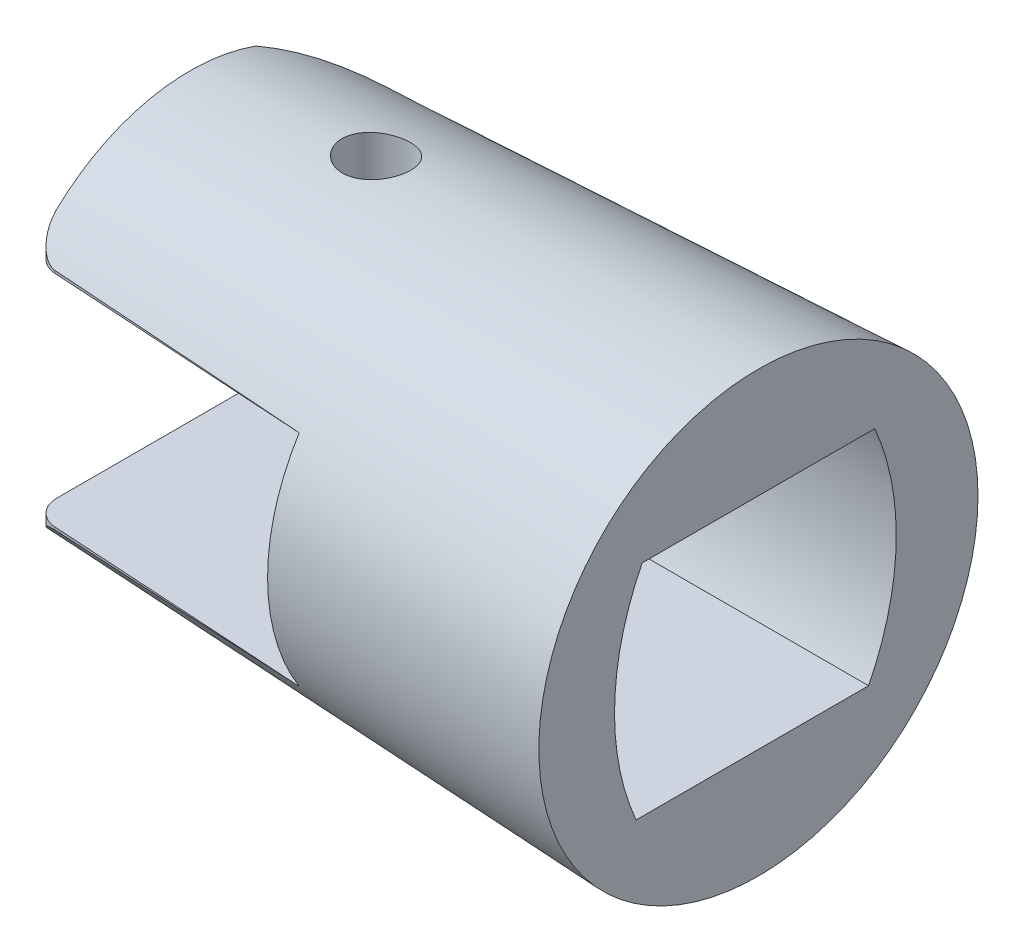
ISO-10303-21;
HEADER;
FILE_DESCRIPTION(('STEP AP214'),'2;1');
FILE_NAME('part.step','',(''),(''),'','','');
FILE_SCHEMA(('AUTOMOTIVE_DESIGN { 1 0 10303 214 1 1 1 1 }'));
ENDSEC;
DATA;
#1=APPLICATION_CONTEXT('core data for automotive mechanical design processes');
#2=APPLICATION_PROTOCOL_DEFINITION('international standard','automotive_design',2000,#1);
#3=PRODUCT_CONTEXT('',#1,'mechanical');
#4=PRODUCT('Part','Part','',(#3));
#5=PRODUCT_RELATED_PRODUCT_CATEGORY('part','',(#4));
#6=PRODUCT_DEFINITION_FORMATION('','',#4);
#7=PRODUCT_DEFINITION_CONTEXT('part definition',#1,'design');
#8=PRODUCT_DEFINITION('design','',#6,#7);
#9=PRODUCT_DEFINITION_SHAPE('','',#8);
#10=(LENGTH_UNIT() NAMED_UNIT(*) SI_UNIT(.MILLI.,.METRE.));
#11=(NAMED_UNIT(*) PLANE_ANGLE_UNIT() SI_UNIT($,.RADIAN.));
#12=(NAMED_UNIT(*) SI_UNIT($,.STERADIAN.) SOLID_ANGLE_UNIT());
#13=UNCERTAINTY_MEASURE_WITH_UNIT(LENGTH_MEASURE(1.E-05),#10,'distance_accuracy_value','');
#14=(GEOMETRIC_REPRESENTATION_CONTEXT(3) GLOBAL_UNCERTAINTY_ASSIGNED_CONTEXT((#13)) GLOBAL_UNIT_ASSIGNED_CONTEXT((#10,
#11,#12)) REPRESENTATION_CONTEXT('',''));
#15=CARTESIAN_POINT('',(0.,0.,0.));
#16=DIRECTION('',(0.,0.,1.));
#17=DIRECTION('',(1.,0.,0.));
#18=AXIS2_PLACEMENT_3D('',#15,#16,#17);
#19=CARTESIAN_POINT('',(-9.1685,0.,8.335));
#20=DIRECTION('',(1.,0.,0.));
#21=DIRECTION('',(0.,0.,-1.));
#22=AXIS2_PLACEMENT_3D('',#19,#20,#21);
#23=PLANE('',#22);
#24=DIRECTION('',(0.,0.,-1.));
#25=VECTOR('',#24,1.);
#26=CARTESIAN_POINT('',(-9.1685,3.542375,8.335));
#27=LINE('',#26,#25);
#28=CARTESIAN_POINT('',(-9.1685,3.542375,5.64923033336179));
#29=VERTEX_POINT('',#28);
#30=CARTESIAN_POINT('',(-9.1685,3.542375,3.75075));
#31=VERTEX_POINT('',#30);
#32=EDGE_CURVE('E238',#29,#31,#27,.T.);
#33=ORIENTED_EDGE('',*,*,#32,.T.);
#34=CARTESIAN_POINT('',(-9.1685,-0.208374999999956,-3.69264300571321));
#35=DIRECTION('',(1.,0.,0.));
#36=DIRECTION('',(0.,0.,-1.));
#37=AXIS2_PLACEMENT_3D('',#34,#35,#36);
#38=CIRCLE('',#37,8.335);
#39=CARTESIAN_POINT('',(-9.1685,-3.542375,3.94651067777816));
#40=VERTEX_POINT('',#39);
#41=EDGE_CURVE('E359',#31,#40,#38,.T.);
#42=ORIENTED_EDGE('',*,*,#41,.T.);
#43=DIRECTION('',(0.,0.,-1.));
#44=VECTOR('',#43,1.);
#45=CARTESIAN_POINT('',(-9.1685,-3.542375,8.335));
#46=LINE('',#45,#44);
#47=CARTESIAN_POINT('',(-9.1685,-3.542375,5.64923033336179));
#48=VERTEX_POINT('',#47);
#49=EDGE_CURVE('E242',#48,#40,#46,.T.);
#50=ORIENTED_EDGE('',*,*,#49,.F.);
#51=CARTESIAN_POINT('',(-9.1685,0.,0.));
#52=DIRECTION('',(1.,0.,0.));
#53=DIRECTION('',(0.,0.,-1.));
#54=AXIS2_PLACEMENT_3D('',#51,#52,#53);
#55=CIRCLE('',#54,6.668);
#56=EDGE_CURVE('E425',#48,#29,#55,.F.);
#57=ORIENTED_EDGE('',*,*,#56,.T.);
#58=EDGE_LOOP('',(#33,#42,#50,#57));
#59=FACE_BOUND('',#58,.T.);
#60=ADVANCED_FACE('F39',(#59),#23,.F.);
#61=CARTESIAN_POINT('',(-18.337,0.,0.));
#62=DIRECTION('',(1.,0.,0.));
#63=DIRECTION('',(0.,0.,-1.));
#64=AXIS2_PLACEMENT_3D('',#61,#62,#63);
#65=CONICAL_SURFACE('',#64,6.25125,0.0454232794215771);
#66=CARTESIAN_POINT('',(-13.5019586071199,6.36971735423623,-1.14055263552959));
#67=CARTESIAN_POINT('',(-13.4617716610966,6.36412320489724,-1.18215851716733));
#68=CARTESIAN_POINT('',(-13.4180697769176,6.35886841394281,-1.22045594766293));
#69=CARTESIAN_POINT('',(-13.3247991760596,6.3495885473435,-1.28933223952378));
#70=CARTESIAN_POINT('',(-13.2752260093137,6.34556441284183,-1.31990519051114));
#71=CARTESIAN_POINT('',(-13.1715607820635,6.33923527470254,-1.37242241009831));
#72=CARTESIAN_POINT('',(-13.117466539542,6.33693110656639,-1.39436248269411));
#73=CARTESIAN_POINT('',(-13.0063419314616,6.33440801953943,-1.42891486433509));
#74=CARTESIAN_POINT('',(-12.9493123346254,6.33418855746263,-1.44152960237701));
#75=CARTESIAN_POINT('',(-12.8347742077037,6.33599941357175,-1.45695979163238));
#76=CARTESIAN_POINT('',(-12.7772828822114,6.33799901770215,-1.45990684419627));
#77=CARTESIAN_POINT('',(-12.66271516082,6.34416589084581,-1.45632592736047));
#78=CARTESIAN_POINT('',(-12.605638771797,6.34833319569773,-1.44979780130418));
#79=CARTESIAN_POINT('',(-12.4935917215413,6.35859421090259,-1.42754270438878));
#80=CARTESIAN_POINT('',(-12.4386178068363,6.36468479763606,-1.4118306143207));
#81=CARTESIAN_POINT('',(-12.3321352976627,6.37839738600322,-1.3717331538246));
#82=CARTESIAN_POINT('',(-12.2806271160016,6.38601956963775,-1.34734675235603));
#83=CARTESIAN_POINT('',(-12.18128278678,6.40246453529107,-1.28997421611997));
#84=CARTESIAN_POINT('',(-12.1335544490278,6.4113103447212,-1.25680804585946));
#85=CARTESIAN_POINT('',(-12.0443049808552,6.4294504705834,-1.18306878783295));
#86=CARTESIAN_POINT('',(-12.0027847443369,6.4387448513507,-1.14249463525903));
#87=CARTESIAN_POINT('',(-11.9261868389199,6.45735080289865,-1.05402953077276));
#88=CARTESIAN_POINT('',(-11.8912716887303,6.46665822080961,-1.00599678847637));
#89=CARTESIAN_POINT('',(-11.8300392561206,6.48443127201885,-0.904587548632134));
#90=CARTESIAN_POINT('',(-11.8037219229022,6.49289691029039,-0.851211082658893));
#91=CARTESIAN_POINT('',(-11.7605673710761,6.50839634642142,-0.740753092794572));
#92=CARTESIAN_POINT('',(-11.7437001489029,6.51543463011493,-0.683683944152812));
#93=CARTESIAN_POINT('',(-11.7199043216311,6.52768142906514,-0.5673206259941));
#94=CARTESIAN_POINT('',(-11.7129742159587,6.53289022049819,-0.508026793807789));
#95=CARTESIAN_POINT('',(-11.7093849880709,6.54112892195211,-0.390331837808212));
#96=CARTESIAN_POINT('',(-11.7124966428106,6.54420553883841,-0.331940938549513));
#97=CARTESIAN_POINT('',(-11.7284528636226,6.54831759628682,-0.216433119904561));
#98=CARTESIAN_POINT('',(-11.7412965600254,6.54935321920535,-0.159316087153193));
#99=CARTESIAN_POINT('',(-11.7760988297337,6.54952034401941,-0.0488478875469218));
#100=CARTESIAN_POINT('',(-11.7979219574535,6.54867935238531,0.00454600412940594));
#101=CARTESIAN_POINT('',(-11.8500413478639,6.54543836097601,0.106971117293568));
#102=CARTESIAN_POINT('',(-11.8803378998413,6.54303830796999,0.156002189757258));
#103=CARTESIAN_POINT('',(-11.9487637690071,6.53706266680899,0.248659267568058));
#104=CARTESIAN_POINT('',(-11.9869420357534,6.53347964418474,0.292248622895797));
#105=CARTESIAN_POINT('',(-12.0699463889913,6.5256183650566,0.372482766406914));
#106=CARTESIAN_POINT('',(-12.1147730135448,6.52134005227914,0.409126991963027));
#107=CARTESIAN_POINT('',(-12.2105192248659,6.51251616246562,0.474949307668604));
#108=CARTESIAN_POINT('',(-12.2615150564167,6.50796769053918,0.50401616441915));
#109=CARTESIAN_POINT('',(-12.3676767434695,6.49912926922087,0.553197692165533));
#110=CARTESIAN_POINT('',(-12.4228426803699,6.49483932487825,0.573312188362952));
#111=CARTESIAN_POINT('',(-12.5360268180653,6.48688441787331,0.604069794275445));
#112=CARTESIAN_POINT('',(-12.5940550496525,6.48322188905757,0.614676666624468));
#113=CARTESIAN_POINT('',(-12.7111177857693,6.47679656328705,0.625960067390901));
#114=CARTESIAN_POINT('',(-12.7701522518324,6.47403373201934,0.626636974563733));
#115=CARTESIAN_POINT('',(-12.8871853496133,6.46951565682789,0.618044415914073));
#116=CARTESIAN_POINT('',(-12.945188009972,6.46775464310156,0.608832807187881));
#117=CARTESIAN_POINT('',(-13.0588447326471,6.46514461624008,0.580803416808242));
#118=CARTESIAN_POINT('',(-13.1144988188864,6.46429559381307,0.561985733029535));
#119=CARTESIAN_POINT('',(-13.2217147354103,6.463291566282,0.515342450749402));
#120=CARTESIAN_POINT('',(-13.2732875432475,6.46313463268588,0.487542114845974));
#121=CARTESIAN_POINT('',(-13.3710551867452,6.46317931937109,0.42370430359521));
#122=CARTESIAN_POINT('',(-13.4172499008782,6.46338094775309,0.38766664216553));
#123=CARTESIAN_POINT('',(-13.503075999236,6.46374889883846,0.308261270240583));
#124=CARTESIAN_POINT('',(-13.5426891103938,6.46391512359644,0.264873805897088));
#125=CARTESIAN_POINT('',(-13.6140744308321,6.46380459058346,0.172067695741732));
#126=CARTESIAN_POINT('',(-13.645846696026,6.46352783597151,0.122649092941949));
#127=CARTESIAN_POINT('',(-13.7006424871472,6.46217164566769,0.0191969680552835));
#128=CARTESIAN_POINT('',(-13.723667328069,6.46109233069637,-0.0348358588813609));
#129=CARTESIAN_POINT('',(-13.7603213138993,6.4578703411098,-0.14596681063447));
#130=CARTESIAN_POINT('',(-13.7739510396044,6.4557277322404,-0.203064745733775));
#131=CARTESIAN_POINT('',(-13.7914128051149,6.45026810792188,-0.318462500793822));
#132=CARTESIAN_POINT('',(-13.7952815611174,6.44695554707829,-0.376756982727878));
#133=CARTESIAN_POINT('',(-13.7932510697703,6.43919387140256,-0.493109693253891));
#134=CARTESIAN_POINT('',(-13.787349941364,6.43474453783999,-0.551167874191741));
#135=CARTESIAN_POINT('',(-13.7659557953699,6.42489931189144,-0.66556489422175));
#136=CARTESIAN_POINT('',(-13.7504366767053,6.41950087249657,-0.721898615498755));
#137=CARTESIAN_POINT('',(-13.7102529447442,6.4081192459103,-0.831103504416173));
#138=CARTESIAN_POINT('',(-13.6855955394343,6.40213652231534,-0.883977362515135));
#139=CARTESIAN_POINT('',(-13.6353283839342,6.39161911118874,-0.971785450895307));
#140=CARTESIAN_POINT('',(-13.6116140479203,6.38711007390803,-1.00782284775294));
#141=CARTESIAN_POINT('',(-13.5599033905768,6.37824365249002,-1.07670352414049));
#142=CARTESIAN_POINT('',(-13.5319070346157,6.37388626957959,-1.10954677783381));
#143=CARTESIAN_POINT('',(-13.5019586071199,6.36971735423623,-1.14055263552959));
#144=B_SPLINE_CURVE_WITH_KNOTS('',3,(#66,#67,#68,#69,#70,#71,#72,#73,#74,#75,#76,#77,#78,#79,
#80,#81,#82,#83,#84,#85,#86,#87,#88,#89,#90,#91,#92,#93,#94,#95,#96,#97,#98,#99,#100,#101,#102,
#103,#104,#105,#106,#107,#108,#109,#110,#111,#112,#113,#114,#115,#116,#117,#118,#119,#120,#121,
#122,#123,#124,#125,#126,#127,#128,#129,#130,#131,#132,#133,#134,#135,#136,#137,#138,#139,#140,
#141,#142,#143),.UNSPECIFIED.,.T.,.F.,(4,2,2,2,2,2,2,2,2,2,2,2,2,2,2,2,2,2,2,2,2,2,2,2,2,2,2,2,
2,2,2,2,2,2,2,2,2,2,4),(0.,0.17419163060013,0.348516142851445,0.522925281043473,
0.697288974362853,0.869269071700755,1.04125201248107,1.21295705848975,1.38468252041971,
1.56024634392888,1.73583542251076,1.91530202996102,2.09476757705439,2.27366005459238,
2.45252551527688,2.62733714810069,2.80213316134307,2.97438395680036,3.14664063370266,
3.32000116030165,3.49337572489717,3.66916783834825,3.84496338406006,4.02142614263797,
4.19788217043695,4.37331136381457,4.54873876980827,4.72367704063105,4.89861926372467,
5.07403935865661,5.24945820262375,5.42485066554725,5.6002322849124,5.77495321053124,
5.94970778016928,6.12493868394182,6.30003166436286,6.42984305195005,6.55965548946091),.UNSPECIFIED.);
#145=CARTESIAN_POINT('',(-13.5019586071199,6.36971735423623,-1.14055263552959));
#146=VERTEX_POINT('',#145);
#147=EDGE_CURVE('E176',#146,#146,#144,.T.);
#148=ORIENTED_EDGE('',*,*,#147,.T.);
#149=EDGE_LOOP('',(#148));
#150=FACE_BOUND('',#149,.T.);
#151=CARTESIAN_POINT('',(-34.6001295167886,0.,4.09215301455892));
#152=DIRECTION('',(-0.0611115794993297,0.,0.998130940734279));
#153=DIRECTION('',(0.998130940734279,0.,0.0611115794993297));
#154=AXIS2_PLACEMENT_3D('',#151,#152,#153);
#155=ELLIPSE('',#154,90.1959478924424,3.69277854081315);
#156=CARTESIAN_POINT('',(-17.5544365015127,-3.62598273709041,5.13579286311213));
#157=VERTEX_POINT('',#156);
#158=EDGE_CURVE('E400',#48,#157,#155,.F.);
#159=ORIENTED_EDGE('',*,*,#158,.T.);
#160=CARTESIAN_POINT('',(-17.5544365015127,-3.62598273709041,5.13579286311213));
#161=CARTESIAN_POINT('',(-17.583578338641,-3.62615305510021,5.13404495612538));
#162=CARTESIAN_POINT('',(-17.6125062314157,-3.62861539501117,5.13070296734978));
#163=CARTESIAN_POINT('',(-17.6689656507649,-3.63752251104676,5.12124743838436));
#164=CARTESIAN_POINT('',(-17.696508765388,-3.64392460620023,5.11516378634124));
#165=CARTESIAN_POINT('',(-17.7564918552416,-3.66214601808035,5.09878250733944));
#166=CARTESIAN_POINT('',(-17.7884538019679,-3.67491465139682,5.08781419705627));
#167=CARTESIAN_POINT('',(-17.8493427885849,-3.70443704825089,5.06293122260578));
#168=CARTESIAN_POINT('',(-17.8782551880181,-3.72120887735227,5.04900323424759));
#169=CARTESIAN_POINT('',(-17.9468773817356,-3.7668456023412,5.01121470566747));
#170=CARTESIAN_POINT('',(-17.9845774938646,-3.79751661816088,4.9859103740255));
#171=CARTESIAN_POINT('',(-18.0534946420006,-3.86262424476388,4.93166864845517));
#172=CARTESIAN_POINT('',(-18.0846979293303,-3.89706861049149,4.9027237537033));
#173=CARTESIAN_POINT('',(-18.1561565024011,-3.9867940927098,4.82612457711569));
#174=CARTESIAN_POINT('',(-18.1925875740409,-4.04353620759744,4.77661404538858));
#175=CARTESIAN_POINT('',(-18.2533209187773,-4.15896232021422,4.67277103625031));
#176=CARTESIAN_POINT('',(-18.2776152478172,-4.21764756308856,4.61843542793194));
#177=CARTESIAN_POINT('',(-18.3094464891307,-4.31968446602477,4.5208072704505));
#178=CARTESIAN_POINT('',(-18.3197091054883,-4.36301387257611,4.47836397856632));
#179=CARTESIAN_POINT('',(-18.3334548818296,-4.44899071780583,4.39207930079882));
#180=CARTESIAN_POINT('',(-18.3369655388141,-4.49164021800987,4.34824432766129));
#181=CARTESIAN_POINT('',(-18.3369999999996,-4.5337625196464,4.30384990188433));
#182=B_SPLINE_CURVE_WITH_KNOTS('',3,(#160,#161,#162,#163,#164,#165,#166,#167,#168,#169,#170,
#171,#172,#173,#174,#175,#176,#177,#178,#179,#180,#181),.UNSPECIFIED.,.F.,.F.,(4,2,2,2,2,2,2,2,
2,2,4),(0.,0.0872990865681886,0.173668681471044,0.281442536723694,0.389712267325943,
0.553177767095839,0.716985755793263,0.966627658277588,1.21643274948652,1.40060693002367,
1.58402946936019),.UNSPECIFIED.);
#183=CARTESIAN_POINT('',(-18.337,-4.53376295265617,4.30385031296005));
#184=VERTEX_POINT('',#183);
#185=EDGE_CURVE('E292',#157,#184,#182,.T.);
#186=ORIENTED_EDGE('',*,*,#185,.T.);
#187=CARTESIAN_POINT('',(-18.337,0.,0.));
#188=DIRECTION('',(1.,0.,0.));
#189=DIRECTION('',(0.,0.,-1.));
#190=AXIS2_PLACEMENT_3D('',#187,#188,#189);
#191=CIRCLE('',#190,6.25125);
#192=CARTESIAN_POINT('',(-18.3369999999998,-5.8780503771636,-2.12759261279666));
#193=VERTEX_POINT('',#192);
#194=EDGE_CURVE('E257',#184,#193,#191,.T.);
#195=ORIENTED_EDGE('',*,*,#194,.T.);
#196=CARTESIAN_POINT('',(-13.7754401732999,-3.26645603018399,-5.57168705696931));
#197=CARTESIAN_POINT('',(-13.8717094362091,-3.29507126284539,-5.54984116061197));
#198=CARTESIAN_POINT('',(-13.9666880454556,-3.32637414193906,-5.52613884687587));
#199=CARTESIAN_POINT('',(-14.1540236520677,-3.39338587430337,-5.47522814931962));
#200=CARTESIAN_POINT('',(-14.2463829346032,-3.42909073201326,-5.44802294400147));
#201=CARTESIAN_POINT('',(-14.5191499221544,-3.54120515527455,-5.36158148398778));
#202=CARTESIAN_POINT('',(-14.6958562728435,-3.62280790989436,-5.29737851759593));
#203=CARTESIAN_POINT('',(-15.0403527723994,-3.79425186113102,-5.15654940984228));
#204=CARTESIAN_POINT('',(-15.2081265578956,-3.88410740753784,-5.07990144470102));
#205=CARTESIAN_POINT('',(-15.5354405550955,-4.06801095022411,-4.91457009551696));
#206=CARTESIAN_POINT('',(-15.6949733652049,-4.16206257863159,-4.82587614321099));
#207=CARTESIAN_POINT('',(-16.004292935241,-4.35019548908239,-4.63770352951522));
#208=CARTESIAN_POINT('',(-16.1541715052233,-4.44426368990333,-4.53836237892293));
#209=CARTESIAN_POINT('',(-16.4462382419243,-4.63120092087278,-4.3280201648454));
#210=CARTESIAN_POINT('',(-16.5884283287625,-4.72407024597643,-4.21702203313578));
#211=CARTESIAN_POINT('',(-16.8645823854979,-4.90643773979513,-3.98347825294889));
#212=CARTESIAN_POINT('',(-16.9985654948046,-4.99594354799199,-3.86096130362993));
#213=CARTESIAN_POINT('',(-17.2580839754008,-5.16995411060878,-3.60406670687434));
#214=CARTESIAN_POINT('',(-17.383620965146,-5.25445982277693,-3.46969134323512));
#215=CARTESIAN_POINT('',(-17.6601114425016,-5.4399008459776,-3.14874656203938));
#216=CARTESIAN_POINT('',(-17.8080603227608,-5.53861914625388,-2.95824383264385));
#217=CARTESIAN_POINT('',(-18.0865513049505,-5.72093712289234,-2.5573704232619));
#218=CARTESIAN_POINT('',(-18.2170416520081,-5.804492098422,-2.34694369653745));
#219=CARTESIAN_POINT('',(-18.3372567700002,-5.87820788440909,-2.12712310623601));
#220=B_SPLINE_CURVE_WITH_KNOTS('',3,(#196,#197,#198,#199,#200,#201,#202,#203,#204,#205,#206,
#207,#208,#209,#210,#211,#212,#213,#214,#215,#216,#217,#218,#219),.UNSPECIFIED.,.F.,.F.,(4,2,2,
2,2,2,2,2,2,2,2,4),(0.,0.308180140413564,0.616082585223789,1.22993431111052,1.84487436158432,
2.4603574428719,3.06867823264603,3.67684639214363,4.28353754533,4.89011211054546,
5.6702363072069,6.4526241866179),.UNSPECIFIED.);
#221=CARTESIAN_POINT('',(-14.5151380486379,-3.542375,-5.36020817523043));
#222=VERTEX_POINT('',#221);
#223=EDGE_CURVE('E230',#222,#193,#220,.T.);
#224=ORIENTED_EDGE('',*,*,#223,.F.);
#225=CARTESIAN_POINT('',(-28.1828731740861,-3.542375,-4.59724186060463));
#226=CARTESIAN_POINT('',(-26.1597058179198,-3.542375,-4.71330833390136));
#227=CARTESIAN_POINT('',(-24.1364489880277,-3.542375,-4.82780201974059));
#228=CARTESIAN_POINT('',(-20.0897889998782,-3.542375,-5.0541442581559));
#229=CARTESIAN_POINT('',(-18.0663858417472,-3.542375,-5.16599281298854));
#230=CARTESIAN_POINT('',(-14.019462891506,-3.542375,-5.38754539849803));
#231=CARTESIAN_POINT('',(-11.9959430994265,-3.542375,-5.49724942973389));
#232=CARTESIAN_POINT('',(-7.94880577235176,-3.542375,-5.71485910581219));
#233=CARTESIAN_POINT('',(-5.92518823730331,-3.542375,-5.82276474966326));
#234=CARTESIAN_POINT('',(-1.1782190409323,-3.542375,-6.0741048749775));
#235=CARTESIAN_POINT('',(1.54516515667846,-3.542375,-6.21692457815734));
#236=CARTESIAN_POINT('',(6.99204974178537,-3.542375,-6.50033658535983));
#237=CARTESIAN_POINT('',(9.71555012930046,-3.542375,-6.6409288890178));
#238=CARTESIAN_POINT('',(15.16263983303,-3.542375,-6.92027747797776));
#239=CARTESIAN_POINT('',(17.8862291490673,-3.542375,-7.05903376673775));
#240=CARTESIAN_POINT('',(23.3334852805473,-3.542375,-7.33499712585375));
#241=CARTESIAN_POINT('',(26.0571520959609,-3.542375,-7.47220419678433));
#242=CARTESIAN_POINT('',(28.7808503916034,-3.542375,-7.60877997507093));
#243=B_SPLINE_CURVE_WITH_KNOTS('',3,(#225,#226,#227,#228,#229,#230,#231,#232,#233,#234,#235,
#236,#237,#238,#239,#240,#241,#242),.UNSPECIFIED.,.F.,.F.,(4,2,2,2,2,2,2,2,4),(0.,
6.07948003611954,12.1589548856321,18.2384281503702,24.3179047663756,32.4992830823333,
40.6806627378307,48.8620269821599,57.0433881920816),.UNSPECIFIED.);
#244=CARTESIAN_POINT('',(-9.1685,-3.542375,-5.64923033336179));
#245=VERTEX_POINT('',#244);
#246=EDGE_CURVE('E311',#222,#245,#243,.T.);
#247=ORIENTED_EDGE('',*,*,#246,.T.);
#248=CARTESIAN_POINT('',(-9.1685,3.542375,-5.64923033336179));
#249=VERTEX_POINT('',#248);
#250=EDGE_CURVE('E316',#249,#245,#55,.F.);
#251=ORIENTED_EDGE('',*,*,#250,.F.);
#252=CARTESIAN_POINT('',(-28.1828731740861,3.542375,-4.59724186060464));
#253=CARTESIAN_POINT('',(-26.1597058179198,3.542375,-4.71330833390137));
#254=CARTESIAN_POINT('',(-24.1364489880277,3.542375,-4.8278020197406));
#255=CARTESIAN_POINT('',(-20.0897889998782,3.542375,-5.0541442581559));
#256=CARTESIAN_POINT('',(-18.0663858417472,3.542375,-5.16599281298855));
#257=CARTESIAN_POINT('',(-14.019462891506,3.542375,-5.38754539849803));
#258=CARTESIAN_POINT('',(-11.9959430994265,3.542375,-5.49724942973389));
#259=CARTESIAN_POINT('',(-7.94880577235176,3.542375,-5.7148591058122));
#260=CARTESIAN_POINT('',(-5.92518823730331,3.542375,-5.82276474966326));
#261=CARTESIAN_POINT('',(-1.1782190409323,3.542375,-6.07410487497751));
#262=CARTESIAN_POINT('',(1.54516515667846,3.542375,-6.21692457815734));
#263=CARTESIAN_POINT('',(6.99204974178537,3.542375,-6.50033658535983));
#264=CARTESIAN_POINT('',(9.71555012930046,3.542375,-6.6409288890178));
#265=CARTESIAN_POINT('',(15.16263983303,3.542375,-6.92027747797776));
#266=CARTESIAN_POINT('',(17.8862291490673,3.542375,-7.05903376673775));
#267=CARTESIAN_POINT('',(23.3334852805473,3.542375,-7.33499712585375));
#268=CARTESIAN_POINT('',(26.0571520959609,3.542375,-7.47220419678433));
#269=CARTESIAN_POINT('',(28.7808503916034,3.542375,-7.60877997507093));
#270=B_SPLINE_CURVE_WITH_KNOTS('',3,(#252,#253,#254,#255,#256,#257,#258,#259,#260,#261,#262,
#263,#264,#265,#266,#267,#268,#269),.UNSPECIFIED.,.F.,.F.,(4,2,2,2,2,2,2,2,4),(0.,
6.07948003611954,12.1589548856321,18.2384281503702,24.3179047663756,32.4992830823333,
40.6806627378307,48.8620269821599,57.0433881920816),.UNSPECIFIED.);
#271=CARTESIAN_POINT('',(-14.5151380486379,3.542375,-5.36020817523043));
#272=VERTEX_POINT('',#271);
#273=EDGE_CURVE('E424',#249,#272,#270,.F.);
#274=ORIENTED_EDGE('',*,*,#273,.T.);
#275=CARTESIAN_POINT('',(-18.3372567700002,5.87820788440909,-2.12712310623601));
#276=CARTESIAN_POINT('',(-18.2424395604814,5.82005483578314,-2.30051742470536));
#277=CARTESIAN_POINT('',(-18.1411831527937,5.75576353208989,-2.46812191867283));
#278=CARTESIAN_POINT('',(-17.9273293567091,5.61710360095545,-2.79109367909126));
#279=CARTESIAN_POINT('',(-17.8147510294962,5.54275184037453,-2.94648075360558));
#280=CARTESIAN_POINT('',(-17.5797606359572,5.38615893981902,-3.24456541866198));
#281=CARTESIAN_POINT('',(-17.4573737545635,5.30393790612259,-3.38729364366424));
#282=CARTESIAN_POINT('',(-17.2034848907378,5.13335369664471,-3.6605387775986));
#283=CARTESIAN_POINT('',(-17.0719789873422,5.04498787870502,-3.79105037628109));
#284=CARTESIAN_POINT('',(-16.8015572048755,4.86466564849641,-4.03904922245365));
#285=CARTESIAN_POINT('',(-16.6626975312815,4.77273760119915,-4.15661867856407));
#286=CARTESIAN_POINT('',(-16.3771789568313,4.58665982928841,-4.37989024635345));
#287=CARTESIAN_POINT('',(-16.2305205151689,4.49251023566143,-4.48559305560658));
#288=CARTESIAN_POINT('',(-15.9296744461771,4.30423752492005,-4.68513106194365));
#289=CARTESIAN_POINT('',(-15.7754965864674,4.21011452520165,-4.77898111490889));
#290=CARTESIAN_POINT('',(-15.4591643939771,4.02432306702093,-4.95497882202438));
#291=CARTESIAN_POINT('',(-15.2970109268726,3.93265434383095,-5.03712774246668));
#292=CARTESIAN_POINT('',(-15.025161451843,3.78771519769094,-5.16154866642994));
#293=CARTESIAN_POINT('',(-14.9180298658031,3.73268896380252,-5.20739829460743));
#294=CARTESIAN_POINT('',(-14.7001549454586,3.62614123199263,-5.29415208735365));
#295=CARTESIAN_POINT('',(-14.5894138065541,3.57461766043271,-5.33505918933544));
#296=CARTESIAN_POINT('',(-14.3639067325856,3.47634493772091,-5.41179363462724));
#297=CARTESIAN_POINT('',(-14.2491362558671,3.42960142268415,-5.44761500028346));
#298=CARTESIAN_POINT('',(-14.0154104531337,3.34264952774669,-5.51383312818371));
#299=CARTESIAN_POINT('',(-13.8964484875353,3.30245214079944,-5.54422077376623));
#300=CARTESIAN_POINT('',(-13.7754401732999,3.26645603018399,-5.57168705696932));
#301=B_SPLINE_CURVE_WITH_KNOTS('',3,(#275,#276,#277,#278,#279,#280,#281,#282,#283,#284,#285,
#286,#287,#288,#289,#290,#291,#292,#293,#294,#295,#296,#297,#298,#299,#300),.UNSPECIFIED.,.F.,
.F.,(4,2,2,2,2,2,2,2,2,2,2,2,4),(0.,0.617485098341034,1.23394749111554,1.84887483766689,
2.46406824783887,3.07509595222048,3.68608771885355,4.29630592250088,4.90645803831515,
5.29290432393561,5.679119797414,6.06578552646683,6.45309403508382),.UNSPECIFIED.);
#302=CARTESIAN_POINT('',(-18.3369999999999,5.87805037716364,-2.12759261279656));
#303=VERTEX_POINT('',#302);
#304=EDGE_CURVE('E396',#303,#272,#301,.T.);
#305=ORIENTED_EDGE('',*,*,#304,.F.);
#306=CARTESIAN_POINT('',(-18.337,4.53376267775259,4.30385040605985));
#307=VERTEX_POINT('',#306);
#308=EDGE_CURVE('E44',#303,#307,#191,.T.);
#309=ORIENTED_EDGE('',*,*,#308,.T.);
#310=CARTESIAN_POINT('',(-18.3369999999998,4.53376234281987,4.30385008815696));
#311=CARTESIAN_POINT('',(-18.3369900089547,4.50243631183631,4.33685678059248));
#312=CARTESIAN_POINT('',(-18.3350396628812,4.47081592953533,4.36956700434915));
#313=CARTESIAN_POINT('',(-18.3273900333436,4.40721040866115,4.43419955101677));
#314=CARTESIAN_POINT('',(-18.3216900127206,4.37522519958087,4.46612171772084));
#315=CARTESIAN_POINT('',(-18.3066065291341,4.31084311379584,4.52924787858201));
#316=CARTESIAN_POINT('',(-18.2971909451586,4.27844509765938,4.56044302779372));
#317=CARTESIAN_POINT('',(-18.2747327034877,4.21379121142174,4.62163022946578));
#318=CARTESIAN_POINT('',(-18.2616907716577,4.18153531418464,4.65162252132191));
#319=CARTESIAN_POINT('',(-18.2230503674995,4.09824001904696,4.72780593516347));
#320=CARTESIAN_POINT('',(-18.1946095189303,4.04751973021607,4.77294189500433));
#321=CARTESIAN_POINT('',(-18.12786512772,3.94898823716194,4.85868115798113));
#322=CARTESIAN_POINT('',(-18.0895970518674,3.90116732063396,4.89930002331051));
#323=CARTESIAN_POINT('',(-18.0199330224465,3.8299414437367,4.9589581727929));
#324=CARTESIAN_POINT('',(-17.9922176130901,3.8046042081269,4.97998567209972));
#325=CARTESIAN_POINT('',(-17.9324935748303,3.75702475093359,5.01936773690545));
#326=CARTESIAN_POINT('',(-17.9004887999445,3.73477978706251,5.03772467139517));
#327=CARTESIAN_POINT('',(-17.8397194678171,3.69948255502465,5.06709705781704));
#328=CARTESIAN_POINT('',(-17.8118581845256,3.68548898965834,5.0788340103767));
#329=CARTESIAN_POINT('',(-17.7536149475135,3.66133275161057,5.09953506443394));
#330=CARTESIAN_POINT('',(-17.7232421107138,3.65115690647025,5.10850868082491));
#331=CARTESIAN_POINT('',(-17.6697745345629,3.63793218691833,5.12091154142763));
#332=CARTESIAN_POINT('',(-17.6471784292876,3.63366614837969,5.12519550411043));
#333=CARTESIAN_POINT('',(-17.6012410610958,3.62776249155237,5.13193182466035));
#334=CARTESIAN_POINT('',(-17.5778961151566,3.62614094210937,5.13437293695599));
#335=CARTESIAN_POINT('',(-17.5544365015127,3.62598273709028,5.13579286311213));
#336=B_SPLINE_CURVE_WITH_KNOTS('',3,(#310,#311,#312,#313,#314,#315,#316,#317,#318,#319,#320,
#321,#322,#323,#324,#325,#326,#327,#328,#329,#330,#331,#332,#333,#334,#335),.UNSPECIFIED.,.F.,
.F.,(4,2,2,2,2,2,2,2,2,2,2,2,4),(0.,0.136455708447652,0.272938251122379,0.41062748284192,
0.548289173912079,0.768389262945237,0.987705901722354,1.11652120417688,1.24522153179053,
1.34482541566969,1.44408240004094,1.51403548911152,1.58441207510343),.UNSPECIFIED.);
#337=CARTESIAN_POINT('',(-17.5544365015127,3.62598273709041,5.13579286311213));
#338=VERTEX_POINT('',#337);
#339=EDGE_CURVE('E352',#307,#338,#336,.T.);
#340=ORIENTED_EDGE('',*,*,#339,.T.);
#341=EDGE_CURVE('E305',#338,#29,#155,.F.);
#342=ORIENTED_EDGE('',*,*,#341,.T.);
#343=ORIENTED_EDGE('',*,*,#56,.F.);
#344=EDGE_LOOP('',(#159,#186,#195,#224,#247,#251,#274,#305,#309,#340,#342,#343));
#345=FACE_BOUND('',#344,.T.);
#346=CARTESIAN_POINT('',(0.,0.,0.));
#347=DIRECTION('',(1.,0.,0.));
#348=DIRECTION('',(0.,0.,-1.));
#349=AXIS2_PLACEMENT_3D('',#346,#347,#348);
#350=CIRCLE('',#349,7.08475);
#351=CARTESIAN_POINT('',(0.,0.,-7.08475));
#352=VERTEX_POINT('',#351);
#353=EDGE_CURVE('E268',#352,#352,#350,.T.);
#354=ORIENTED_EDGE('',*,*,#353,.F.);
#355=EDGE_LOOP('',(#354));
#356=FACE_BOUND('',#355,.T.);
#357=CARTESIAN_POINT('',(-13.5019586071199,-6.36971735423623,-1.14055263552959));
#358=CARTESIAN_POINT('',(-13.5428066719975,-6.37540413546996,-1.09825628586421));
#359=CARTESIAN_POINT('',(-13.58006763611,-6.38144762587365,-1.05249409508984));
#360=CARTESIAN_POINT('',(-13.6463663917079,-6.39366897575192,-0.95532410621586));
#361=CARTESIAN_POINT('',(-13.675395443402,-6.39984697059432,-0.903910387647764));
#362=CARTESIAN_POINT('',(-13.7243799393292,-6.41180688956142,-0.796895358709543));
#363=CARTESIAN_POINT('',(-13.7443377916653,-6.4175889184554,-0.741295164284132));
#364=CARTESIAN_POINT('',(-13.7745922763909,-6.4283343882504,-0.627464137100737));
#365=CARTESIAN_POINT('',(-13.7848915364711,-6.43329805149072,-0.569234024352606));
#366=CARTESIAN_POINT('',(-13.795482613092,-6.44211012834874,-0.452019333780099));
#367=CARTESIAN_POINT('',(-13.7958138836755,-6.44596287900734,-0.393038655073471));
#368=CARTESIAN_POINT('',(-13.7865198788824,-6.45246534078592,-0.275798179031299));
#369=CARTESIAN_POINT('',(-13.7768946954792,-6.45511506301864,-0.217538375041654));
#370=CARTESIAN_POINT('',(-13.7480693396878,-6.45924947972682,-0.103942480535167));
#371=CARTESIAN_POINT('',(-13.7289540063645,-6.4607442021743,-0.0485852053769126));
#372=CARTESIAN_POINT('',(-13.68172462358,-6.46281230927653,0.058165360284551));
#373=CARTESIAN_POINT('',(-13.6536105611033,-6.46338569259868,0.109558645054151));
#374=CARTESIAN_POINT('',(-13.5891901188293,-6.46393227871482,0.206902401992447));
#375=CARTESIAN_POINT('',(-13.5528864295416,-6.46390567833591,0.252854654141268));
#376=CARTESIAN_POINT('',(-13.4731054118816,-6.46364280390668,0.338040680446865));
#377=CARTESIAN_POINT('',(-13.4296279433928,-6.46340652576059,0.377274323346919));
#378=CARTESIAN_POINT('',(-13.3365559292968,-6.46312850546019,0.448045007153658));
#379=CARTESIAN_POINT('',(-13.2869400397184,-6.46308746284258,0.47955398856088));
#380=CARTESIAN_POINT('',(-13.1831256077271,-6.46356915635617,0.533796130358704));
#381=CARTESIAN_POINT('',(-13.1289271373615,-6.4640918836253,0.556529428689405));
#382=CARTESIAN_POINT('',(-13.0175571697455,-6.46597288758107,0.592554803398235));
#383=CARTESIAN_POINT('',(-12.9603889939032,-6.46733024845496,0.605857193568015));
#384=CARTESIAN_POINT('',(-12.844663314385,-6.47101591087335,0.622690981246411));
#385=CARTESIAN_POINT('',(-12.7861058338046,-6.47334419628806,0.626222541068428));
#386=CARTESIAN_POINT('',(-12.6693964462181,-6.47894246968521,0.623437112675399));
#387=CARTESIAN_POINT('',(-12.6112439446177,-6.48221046308233,0.617140860517185));
#388=CARTESIAN_POINT('',(-12.4968522242489,-6.48950690164895,0.594940235551906));
#389=CARTESIAN_POINT('',(-12.4406130754527,-6.49353537459441,0.579035511755842));
#390=CARTESIAN_POINT('',(-12.3313713203522,-6.50204700502672,0.537991503387275));
#391=CARTESIAN_POINT('',(-12.2783836829152,-6.50653204451106,0.512812775248386));
#392=CARTESIAN_POINT('',(-12.1773727377081,-6.51550660546867,0.453935017402477));
#393=CARTESIAN_POINT('',(-12.1293496539915,-6.519996127135,0.420235603387744));
#394=CARTESIAN_POINT('',(-12.0393855658984,-6.52850201150356,0.345058727880965));
#395=CARTESIAN_POINT('',(-11.9974749272108,-6.53251599445531,0.303544633858116));
#396=CARTESIAN_POINT('',(-11.921213481326,-6.53952980542418,0.213996566480572));
#397=CARTESIAN_POINT('',(-11.8868623454935,-6.5425296775309,0.165962876700009));
#398=CARTESIAN_POINT('',(-11.8269348277394,-6.54703158168007,0.0650785303528139));
#399=CARTESIAN_POINT('',(-11.8013004456612,-6.54854364632992,0.0122627977169098));
#400=CARTESIAN_POINT('',(-11.7592498270952,-6.54974856565019,-0.0969367692239333));
#401=CARTESIAN_POINT('',(-11.7428325982603,-6.54944161620243,-0.153320218689877));
#402=CARTESIAN_POINT('',(-11.7198553042288,-6.54682348990759,-0.267181523229824));
#403=CARTESIAN_POINT('',(-11.7131589331714,-6.54454075878839,-0.32463257054337));
#404=CARTESIAN_POINT('',(-11.7093381467646,-6.53798954912127,-0.439736106240893));
#405=CARTESIAN_POINT('',(-11.7122135149673,-6.53372111547836,-0.497388590040291));
#406=CARTESIAN_POINT('',(-11.7273695134134,-6.5233695265392,-0.611163607541459));
#407=CARTESIAN_POINT('',(-11.7396330960223,-6.51728967272837,-0.667288723638848));
#408=CARTESIAN_POINT('',(-11.7731230352385,-6.50363647241209,-0.776604568757451));
#409=CARTESIAN_POINT('',(-11.7943502905901,-6.4960629761869,-0.82979500292741));
#410=CARTESIAN_POINT('',(-11.8455999878006,-6.47972704690479,-0.932807619630453));
#411=CARTESIAN_POINT('',(-11.8757774011026,-6.47094526439383,-0.982549600954845));
#412=CARTESIAN_POINT('',(-11.9439192710086,-6.45287796684749,-1.07627879794079));
#413=CARTESIAN_POINT('',(-11.9818848539835,-6.44359237909188,-1.12026517968488));
#414=CARTESIAN_POINT('',(-12.0654659929492,-6.42495285512492,-1.20218844351161));
#415=CARTESIAN_POINT('',(-12.1112240780989,-6.41560150595709,-1.23998067963119));
#416=CARTESIAN_POINT('',(-12.2085943979047,-6.39770193589193,-1.30732262628573));
#417=CARTESIAN_POINT('',(-12.2602066786277,-6.38915372131545,-1.33687227195324));
#418=CARTESIAN_POINT('',(-12.3677702071476,-6.37350436483881,-1.38677828407294));
#419=CARTESIAN_POINT('',(-12.4237117123966,-6.36640009711033,-1.40715462753422));
#420=CARTESIAN_POINT('',(-12.5384426340422,-6.35413125620062,-1.43811675124382));
#421=CARTESIAN_POINT('',(-12.5972314632167,-6.34896628497264,-1.44870454127684));
#422=CARTESIAN_POINT('',(-12.7144234237395,-6.34101626408846,-1.45954730904702));
#423=CARTESIAN_POINT('',(-12.7727994980116,-6.33817498065284,-1.46005382267844));
#424=CARTESIAN_POINT('',(-12.8888921082784,-6.33477066263918,-1.45130399998122));
#425=CARTESIAN_POINT('',(-12.9466085934223,-6.33420780254951,-1.44204691599593));
#426=CARTESIAN_POINT('',(-13.0586557214499,-6.33524479705474,-1.4142854322848));
#427=CARTESIAN_POINT('',(-13.1130282198882,-6.3368065349373,-1.39594766829388));
#428=CARTESIAN_POINT('',(-13.2179276952477,-6.34173831671997,-1.35065872624296));
#429=CARTESIAN_POINT('',(-13.2684579968444,-6.34510677644521,-1.32371510235614));
#430=CARTESIAN_POINT('',(-13.3501540149434,-6.35202158357101,-1.27114392131203));
#431=CARTESIAN_POINT('',(-13.3826314440032,-6.35522160165655,-1.24747768994045));
#432=CARTESIAN_POINT('',(-13.4446142054502,-6.36213162936857,-1.1965951721605));
#433=CARTESIAN_POINT('',(-13.4741194771092,-6.36584164941194,-1.1693788132407));
#434=CARTESIAN_POINT('',(-13.5019586071199,-6.36971735423623,-1.14055263552959));
#435=B_SPLINE_CURVE_WITH_KNOTS('',3,(#357,#358,#359,#360,#361,#362,#363,#364,#365,#366,#367,
#368,#369,#370,#371,#372,#373,#374,#375,#376,#377,#378,#379,#380,#381,#382,#383,#384,#385,#386,
#387,#388,#389,#390,#391,#392,#393,#394,#395,#396,#397,#398,#399,#400,#401,#402,#403,#404,#405,
#406,#407,#408,#409,#410,#411,#412,#413,#414,#415,#416,#417,#418,#419,#420,#421,#422,#423,#424,
#425,#426,#427,#428,#429,#430,#431,#432,#433,#434),.UNSPECIFIED.,.T.,.F.,(4,2,2,2,2,2,2,2,2,2,2,
2,2,2,2,2,2,2,2,2,2,2,2,2,2,2,2,2,2,2,2,2,2,2,2,2,2,2,4),(0.,0.177079519336537,
0.354346345418274,0.531566085501362,0.708737597658677,0.885207759178159,1.06167629055631,
1.23659490897275,1.41151378039088,1.58637526979504,1.76124017495492,1.93673115851378,
2.11221938351477,2.28751539450684,2.4628084934575,2.63773223479838,2.81266236633577,
2.98834525568955,3.16403607026642,3.34057195284006,3.51710015932786,3.69242966905348,
3.86774029864065,4.04056815322662,4.21339209964448,4.38590296508283,4.55843113146396,
4.73414085039141,4.90987599942968,5.08926166821072,5.26864874867934,5.44764325939297,
5.62660101080624,5.80108786770941,5.97558808707765,6.14699859382478,6.31825904904722,
6.43894136464973,6.5596261455771),.UNSPECIFIED.);
#436=CARTESIAN_POINT('',(-13.5019586071199,-6.36971735423623,-1.14055263552959));
#437=VERTEX_POINT('',#436);
#438=EDGE_CURVE('E183',#437,#437,#435,.T.);
#439=ORIENTED_EDGE('',*,*,#438,.T.);
#440=EDGE_LOOP('',(#439));
#441=FACE_BOUND('',#440,.T.);
#442=ADVANCED_FACE('F187',(#150,#345,#356,#441),#65,.T.);
#443=CARTESIAN_POINT('',(-18.337,0.,0.));
#444=DIRECTION('',(1.,0.,0.));
#445=DIRECTION('',(0.,0.,-1.));
#446=AXIS2_PLACEMENT_3D('',#443,#444,#445);
#447=PLANE('',#446);
#448=ORIENTED_EDGE('',*,*,#194,.F.);
#449=DIRECTION('',(0.,-1.,0.));
#450=VECTOR('',#449,1.);
#451=CARTESIAN_POINT('',(-18.337,-3.542375,4.30385072401011));
#452=LINE('',#451,#450);
#453=CARTESIAN_POINT('',(-18.337,-3.542375,4.30385072401011));
#454=VERTEX_POINT('',#453);
#455=EDGE_CURVE('E294',#184,#454,#452,.F.);
#456=ORIENTED_EDGE('',*,*,#455,.T.);
#457=DIRECTION('',(0.,0.,1.));
#458=VECTOR('',#457,1.);
#459=CARTESIAN_POINT('',(-18.337,-3.542375,0.));
#460=LINE('',#459,#458);
#461=CARTESIAN_POINT('',(-18.337,-3.542375,-2.12759261279635));
#462=VERTEX_POINT('',#461);
#463=EDGE_CURVE('E252',#462,#454,#460,.T.);
#464=ORIENTED_EDGE('',*,*,#463,.F.);
#465=DIRECTION('',(0.,-1.,0.));
#466=VECTOR('',#465,1.);
#467=CARTESIAN_POINT('',(-18.337,8.335,-2.12759261279635));
#468=LINE('',#467,#466);
#469=EDGE_CURVE('E232',#462,#193,#468,.T.);
#470=ORIENTED_EDGE('',*,*,#469,.T.);
#471=EDGE_LOOP('',(#448,#456,#464,#470));
#472=FACE_BOUND('',#471,.T.);
#473=ADVANCED_FACE('F379',(#472),#447,.F.);
#474=DIRECTION('',(0.,0.,-1.));
#475=VECTOR('',#474,1.);
#476=CARTESIAN_POINT('',(-18.337,3.542375,0.));
#477=LINE('',#476,#475);
#478=CARTESIAN_POINT('',(-18.337,3.542375,4.30385072401011));
#479=VERTEX_POINT('',#478);
#480=CARTESIAN_POINT('',(-18.337,3.542375,-2.12759261279635));
#481=VERTEX_POINT('',#480);
#482=EDGE_CURVE('E244',#479,#481,#477,.T.);
#483=ORIENTED_EDGE('',*,*,#482,.F.);
#484=DIRECTION('',(0.,-1.,0.));
#485=VECTOR('',#484,1.);
#486=CARTESIAN_POINT('',(-18.337,3.63202492734538,4.30385072401011));
#487=LINE('',#486,#485);
#488=EDGE_CURVE('E12',#479,#307,#487,.F.);
#489=ORIENTED_EDGE('',*,*,#488,.T.);
#490=ORIENTED_EDGE('',*,*,#308,.F.);
#491=DIRECTION('',(0.,-1.,0.));
#492=VECTOR('',#491,1.);
#493=CARTESIAN_POINT('',(-18.337,8.335,-2.12759261279635));
#494=LINE('',#493,#492);
#495=EDGE_CURVE('E394',#303,#481,#494,.T.);
#496=ORIENTED_EDGE('',*,*,#495,.T.);
#497=EDGE_LOOP('',(#483,#489,#490,#496));
#498=FACE_BOUND('',#497,.T.);
#499=ADVANCED_FACE('F373',(#498),#447,.F.);
#500=CARTESIAN_POINT('',(0.,-3.542375,8.335));
#501=DIRECTION('',(0.,1.,0.));
#502=DIRECTION('',(0.,0.,1.));
#503=AXIS2_PLACEMENT_3D('',#500,#501,#502);
#504=PLANE('',#503);
#505=ORIENTED_EDGE('',*,*,#463,.T.);
#506=CARTESIAN_POINT('',(-17.5035,-3.542375,4.30385072401011));
#507=DIRECTION('',(0.,1.,0.));
#508=DIRECTION('',(0.,0.,1.));
#509=AXIS2_PLACEMENT_3D('',#506,#507,#508);
#510=CIRCLE('',#509,0.8335);
#511=CARTESIAN_POINT('',(-17.5544365015127,-3.542375,5.13579286311213));
#512=VERTEX_POINT('',#511);
#513=EDGE_CURVE('E296',#454,#512,#510,.T.);
#514=ORIENTED_EDGE('',*,*,#513,.T.);
#515=DIRECTION('',(0.998130940734279,0.,0.0611115794993297));
#516=VECTOR('',#515,1.);
#517=CARTESIAN_POINT('',(0.129583944084626,-3.542375,6.21851495620131));
#518=LINE('',#517,#516);
#519=EDGE_CURVE('E403',#512,#48,#518,.T.);
#520=ORIENTED_EDGE('',*,*,#519,.T.);
#521=ORIENTED_EDGE('',*,*,#49,.T.);
#522=DIRECTION('',(1.,0.,0.));
#523=VECTOR('',#522,1.);
#524=CARTESIAN_POINT('',(-10.002,-3.542375,3.94651067777816));
#525=LINE('',#524,#523);
#526=CARTESIAN_POINT('',(0.,-3.542375,3.94651067777816));
#527=VERTEX_POINT('',#526);
#528=EDGE_CURVE('E147',#40,#527,#525,.T.);
#529=ORIENTED_EDGE('',*,*,#528,.T.);
#530=DIRECTION('',(0.,0.,-1.));
#531=VECTOR('',#530,1.);
#532=CARTESIAN_POINT('',(0.,-3.542375,3.94651067777816));
#533=LINE('',#532,#531);
#534=CARTESIAN_POINT('',(0.,-3.542375,-3.55498932222185));
#535=VERTEX_POINT('',#534);
#536=EDGE_CURVE('E151',#527,#535,#533,.T.);
#537=ORIENTED_EDGE('',*,*,#536,.T.);
#538=DIRECTION('',(1.,0.,0.));
#539=VECTOR('',#538,1.);
#540=CARTESIAN_POINT('',(-10.002,-3.542375,-3.55498932222185));
#541=LINE('',#540,#539);
#542=CARTESIAN_POINT('',(-9.1685,-3.542375,-3.55498932222185));
#543=VERTEX_POINT('',#542);
#544=EDGE_CURVE('E136',#543,#535,#541,.T.);
#545=ORIENTED_EDGE('',*,*,#544,.F.);
#546=EDGE_CURVE('E241',#543,#245,#46,.T.);
#547=ORIENTED_EDGE('',*,*,#546,.T.);
#548=ORIENTED_EDGE('',*,*,#246,.F.);
#549=CARTESIAN_POINT('',(-12.2369957737578,-3.542375,1.20876389859225));
#550=DIRECTION('',(0.,1.,0.));
#551=DIRECTION('',(0.,0.,1.));
#552=AXIS2_PLACEMENT_3D('',#549,#550,#551);
#553=CIRCLE('',#552,6.95279270014995);
#554=EDGE_CURVE('E393',#462,#222,#553,.F.);
#555=ORIENTED_EDGE('',*,*,#554,.F.);
#556=EDGE_LOOP('',(#505,#514,#520,#521,#529,#537,#545,#547,#548,#555));
#557=FACE_BOUND('',#556,.T.);
#558=CARTESIAN_POINT('',(-12.75255,-3.542375,-0.41675));
#559=DIRECTION('',(0.,1.,0.));
#560=DIRECTION('',(0.,0.,1.));
#561=AXIS2_PLACEMENT_3D('',#558,#559,#560);
#562=CIRCLE('',#561,1.041875);
#563=CARTESIAN_POINT('',(-12.75255,-3.542375,0.625124999999999));
#564=VERTEX_POINT('',#563);
#565=EDGE_CURVE('E173',#564,#564,#562,.F.);
#566=ORIENTED_EDGE('',*,*,#565,.T.);
#567=EDGE_LOOP('',(#566));
#568=FACE_BOUND('',#567,.T.);
#569=ADVANCED_FACE('F153',(#557,#568),#504,.T.);
#570=CARTESIAN_POINT('',(0.,3.542375,8.335));
#571=DIRECTION('',(0.,-1.,0.));
#572=DIRECTION('',(1.,0.,0.));
#573=AXIS2_PLACEMENT_3D('',#570,#571,#572);
#574=PLANE('',#573);
#575=DIRECTION('',(-0.998130940734279,0.,-0.0611115794993297));
#576=VECTOR('',#575,1.);
#577=CARTESIAN_POINT('',(0.129583944084626,3.542375,6.21851495620131));
#578=LINE('',#577,#576);
#579=CARTESIAN_POINT('',(-17.5544365015127,3.542375,5.13579286311213));
#580=VERTEX_POINT('',#579);
#581=EDGE_CURVE('E303',#29,#580,#578,.T.);
#582=ORIENTED_EDGE('',*,*,#581,.T.);
#583=CARTESIAN_POINT('',(-17.5035,3.542375,4.30385072401011));
#584=DIRECTION('',(0.,-1.,0.));
#585=DIRECTION('',(1.,0.,0.));
#586=AXIS2_PLACEMENT_3D('',#583,#584,#585);
#587=CIRCLE('',#586,0.8335);
#588=EDGE_CURVE('E50',#580,#479,#587,.T.);
#589=ORIENTED_EDGE('',*,*,#588,.T.);
#590=ORIENTED_EDGE('',*,*,#482,.T.);
#591=CARTESIAN_POINT('',(-12.2369957737578,3.542375,1.20876389859225));
#592=DIRECTION('',(0.,-1.,0.));
#593=DIRECTION('',(1.,0.,0.));
#594=AXIS2_PLACEMENT_3D('',#591,#592,#593);
#595=CIRCLE('',#594,6.95279270014995);
#596=EDGE_CURVE('E310',#272,#481,#595,.F.);
#597=ORIENTED_EDGE('',*,*,#596,.F.);
#598=ORIENTED_EDGE('',*,*,#273,.F.);
#599=CARTESIAN_POINT('',(-9.1685,3.542375,-3.75075));
#600=VERTEX_POINT('',#599);
#601=EDGE_CURVE('E235',#600,#249,#27,.T.);
#602=ORIENTED_EDGE('',*,*,#601,.F.);
#603=DIRECTION('',(1.,0.,0.));
#604=VECTOR('',#603,1.);
#605=CARTESIAN_POINT('',(-10.002,3.542375,-3.75075));
#606=LINE('',#605,#604);
#607=CARTESIAN_POINT('',(0.,3.542375,-3.75075));
#608=VERTEX_POINT('',#607);
#609=EDGE_CURVE('E146',#600,#608,#606,.T.);
#610=ORIENTED_EDGE('',*,*,#609,.T.);
#611=DIRECTION('',(0.,0.,1.));
#612=VECTOR('',#611,1.);
#613=CARTESIAN_POINT('',(0.,3.542375,3.75075));
#614=LINE('',#613,#612);
#615=CARTESIAN_POINT('',(0.,3.542375,3.75075));
#616=VERTEX_POINT('',#615);
#617=EDGE_CURVE('E163',#608,#616,#614,.T.);
#618=ORIENTED_EDGE('',*,*,#617,.T.);
#619=DIRECTION('',(1.,0.,0.));
#620=VECTOR('',#619,1.);
#621=CARTESIAN_POINT('',(-10.002,3.542375,3.75075));
#622=LINE('',#621,#620);
#623=EDGE_CURVE('E168',#31,#616,#622,.T.);
#624=ORIENTED_EDGE('',*,*,#623,.F.);
#625=ORIENTED_EDGE('',*,*,#32,.F.);
#626=EDGE_LOOP('',(#582,#589,#590,#597,#598,#602,#610,#618,#624,#625));
#627=FACE_BOUND('',#626,.T.);
#628=CARTESIAN_POINT('',(-12.75255,3.542375,-0.41675));
#629=DIRECTION('',(0.,-1.,0.));
#630=DIRECTION('',(1.,0.,0.));
#631=AXIS2_PLACEMENT_3D('',#628,#629,#630);
#632=CIRCLE('',#631,1.041875);
#633=CARTESIAN_POINT('',(-11.710675,3.542375,-0.41675));
#634=VERTEX_POINT('',#633);
#635=EDGE_CURVE('E170',#634,#634,#632,.F.);
#636=ORIENTED_EDGE('',*,*,#635,.T.);
#637=EDGE_LOOP('',(#636));
#638=FACE_BOUND('',#637,.T.);
#639=ADVANCED_FACE('F212',(#627,#638),#574,.T.);
#640=CARTESIAN_POINT('',(0.,0.,0.));
#641=DIRECTION('',(1.,0.,0.));
#642=DIRECTION('',(0.,0.,-1.));
#643=AXIS2_PLACEMENT_3D('',#640,#641,#642);
#644=PLANE('',#643);
#645=CARTESIAN_POINT('',(0.,-0.208374999999956,-3.69264300571321));
#646=DIRECTION('',(1.,0.,0.));
#647=DIRECTION('',(0.,0.,-1.));
#648=AXIS2_PLACEMENT_3D('',#645,#646,#647);
#649=CIRCLE('',#648,8.335);
#650=EDGE_CURVE('E158',#616,#527,#649,.T.);
#651=ORIENTED_EDGE('',*,*,#650,.F.);
#652=ORIENTED_EDGE('',*,*,#617,.F.);
#653=CARTESIAN_POINT('',(0.,0.208374999999957,3.88840368349137));
#654=DIRECTION('',(1.,0.,0.));
#655=DIRECTION('',(0.,0.,1.));
#656=AXIS2_PLACEMENT_3D('',#653,#654,#655);
#657=CIRCLE('',#656,8.335);
#658=EDGE_CURVE('E140',#535,#608,#657,.T.);
#659=ORIENTED_EDGE('',*,*,#658,.F.);
#660=ORIENTED_EDGE('',*,*,#536,.F.);
#661=EDGE_LOOP('',(#651,#652,#659,#660));
#662=FACE_BOUND('',#661,.T.);
#663=ORIENTED_EDGE('',*,*,#353,.T.);
#664=EDGE_LOOP('',(#663));
#665=FACE_BOUND('',#664,.T.);
#666=ADVANCED_FACE('F160',(#662,#665),#644,.T.);
#667=ORIENTED_EDGE('',*,*,#546,.F.);
#668=CARTESIAN_POINT('',(-9.1685,0.208374999999957,3.88840368349137));
#669=DIRECTION('',(1.,0.,0.));
#670=DIRECTION('',(0.,0.,-1.));
#671=AXIS2_PLACEMENT_3D('',#668,#669,#670);
#672=CIRCLE('',#671,8.335);
#673=EDGE_CURVE('E143',#543,#600,#672,.T.);
#674=ORIENTED_EDGE('',*,*,#673,.T.);
#675=ORIENTED_EDGE('',*,*,#601,.T.);
#676=ORIENTED_EDGE('',*,*,#250,.T.);
#677=EDGE_LOOP('',(#667,#674,#675,#676));
#678=FACE_BOUND('',#677,.T.);
#679=ADVANCED_FACE('F280',(#678),#23,.F.);
#680=CARTESIAN_POINT('',(-0.37882903764113,8.335,6.18738685558521));
#681=DIRECTION('',(-0.0611115794993297,0.,0.998130940734279));
#682=DIRECTION('',(0.998130940734279,0.,0.0611115794993297));
#683=AXIS2_PLACEMENT_3D('',#680,#681,#682);
#684=PLANE('',#683);
#685=ORIENTED_EDGE('',*,*,#341,.F.);
#686=DIRECTION('',(0.,-1.,0.));
#687=VECTOR('',#686,1.);
#688=CARTESIAN_POINT('',(-17.5544365015127,3.542375,5.13579286311213));
#689=LINE('',#688,#687);
#690=EDGE_CURVE('E253',#338,#580,#689,.T.);
#691=ORIENTED_EDGE('',*,*,#690,.T.);
#692=ORIENTED_EDGE('',*,*,#581,.F.);
#693=EDGE_LOOP('',(#685,#691,#692));
#694=FACE_BOUND('',#693,.T.);
#695=ADVANCED_FACE('F207',(#694),#684,.T.);
#696=CARTESIAN_POINT('',(-12.2369957737578,8.335,1.20876389859225));
#697=DIRECTION('',(0.,-1.,0.));
#698=DIRECTION('',(0.,0.,-1.));
#699=AXIS2_PLACEMENT_3D('',#696,#697,#698);
#700=CYLINDRICAL_SURFACE('',#699,6.95279270014995);
#701=ORIENTED_EDGE('',*,*,#304,.T.);
#702=ORIENTED_EDGE('',*,*,#596,.T.);
#703=ORIENTED_EDGE('',*,*,#495,.F.);
#704=EDGE_LOOP('',(#701,#702,#703));
#705=FACE_BOUND('',#704,.T.);
#706=ADVANCED_FACE('F205',(#705),#700,.T.);
#707=ORIENTED_EDGE('',*,*,#519,.F.);
#708=DIRECTION('',(0.,-1.,0.));
#709=VECTOR('',#708,1.);
#710=CARTESIAN_POINT('',(-17.5544365015127,-3.63202844495036,5.13579286311213));
#711=LINE('',#710,#709);
#712=EDGE_CURVE('E353',#512,#157,#711,.T.);
#713=ORIENTED_EDGE('',*,*,#712,.T.);
#714=ORIENTED_EDGE('',*,*,#158,.F.);
#715=EDGE_LOOP('',(#707,#713,#714));
#716=FACE_BOUND('',#715,.T.);
#717=ADVANCED_FACE('F201',(#716),#684,.T.);
#718=ORIENTED_EDGE('',*,*,#554,.T.);
#719=ORIENTED_EDGE('',*,*,#223,.T.);
#720=ORIENTED_EDGE('',*,*,#469,.F.);
#721=EDGE_LOOP('',(#718,#719,#720));
#722=FACE_BOUND('',#721,.T.);
#723=ADVANCED_FACE('F197',(#722),#700,.T.);
#724=CARTESIAN_POINT('',(-12.75255,8.335,-0.41675));
#725=DIRECTION('',(0.,-1.,0.));
#726=DIRECTION('',(0.,0.,-1.));
#727=AXIS2_PLACEMENT_3D('',#724,#725,#726);
#728=CYLINDRICAL_SURFACE('',#727,1.041875);
#729=ORIENTED_EDGE('',*,*,#147,.F.);
#730=EDGE_LOOP('',(#729));
#731=FACE_BOUND('',#730,.T.);
#732=ORIENTED_EDGE('',*,*,#635,.F.);
#733=EDGE_LOOP('',(#732));
#734=FACE_BOUND('',#733,.T.);
#735=ADVANCED_FACE('F191',(#731,#734),#728,.F.);
#736=ORIENTED_EDGE('',*,*,#438,.F.);
#737=EDGE_LOOP('',(#736));
#738=FACE_BOUND('',#737,.T.);
#739=ORIENTED_EDGE('',*,*,#565,.F.);
#740=EDGE_LOOP('',(#739));
#741=FACE_BOUND('',#740,.T.);
#742=ADVANCED_FACE('F196',(#738,#741),#728,.F.);
#743=CARTESIAN_POINT('',(-10.002,-0.208374999999956,-3.69264300571321));
#744=DIRECTION('',(1.,0.,0.));
#745=DIRECTION('',(0.,0.,-1.));
#746=AXIS2_PLACEMENT_3D('',#743,#744,#745);
#747=CYLINDRICAL_SURFACE('',#746,8.335);
#748=ORIENTED_EDGE('',*,*,#623,.T.);
#749=ORIENTED_EDGE('',*,*,#650,.T.);
#750=ORIENTED_EDGE('',*,*,#528,.F.);
#751=ORIENTED_EDGE('',*,*,#41,.F.);
#752=EDGE_LOOP('',(#748,#749,#750,#751));
#753=FACE_BOUND('',#752,.T.);
#754=ADVANCED_FACE('F199',(#753),#747,.F.);
#755=CARTESIAN_POINT('',(-10.002,0.208374999999957,3.88840368349137));
#756=DIRECTION('',(1.,0.,0.));
#757=DIRECTION('',(0.,0.,-1.));
#758=AXIS2_PLACEMENT_3D('',#755,#756,#757);
#759=CYLINDRICAL_SURFACE('',#758,8.335);
#760=ORIENTED_EDGE('',*,*,#544,.T.);
#761=ORIENTED_EDGE('',*,*,#658,.T.);
#762=ORIENTED_EDGE('',*,*,#609,.F.);
#763=ORIENTED_EDGE('',*,*,#673,.F.);
#764=EDGE_LOOP('',(#760,#761,#762,#763));
#765=FACE_BOUND('',#764,.T.);
#766=ADVANCED_FACE('F138',(#765),#759,.F.);
#767=CARTESIAN_POINT('',(-17.5035,8.335,4.30385072401011));
#768=DIRECTION('',(0.,1.,0.));
#769=DIRECTION('',(0.,0.,1.));
#770=AXIS2_PLACEMENT_3D('',#767,#768,#769);
#771=CYLINDRICAL_SURFACE('',#770,0.8335);
#772=ORIENTED_EDGE('',*,*,#513,.F.);
#773=ORIENTED_EDGE('',*,*,#455,.F.);
#774=ORIENTED_EDGE('',*,*,#185,.F.);
#775=ORIENTED_EDGE('',*,*,#712,.F.);
#776=EDGE_LOOP('',(#772,#773,#774,#775));
#777=FACE_BOUND('',#776,.T.);
#778=ADVANCED_FACE('F281',(#777),#771,.T.);
#779=CARTESIAN_POINT('',(-17.5035,8.335,4.30385072401011));
#780=DIRECTION('',(0.,1.,0.));
#781=DIRECTION('',(0.,0.,1.));
#782=AXIS2_PLACEMENT_3D('',#779,#780,#781);
#783=CYLINDRICAL_SURFACE('',#782,0.8335);
#784=ORIENTED_EDGE('',*,*,#339,.F.);
#785=ORIENTED_EDGE('',*,*,#488,.F.);
#786=ORIENTED_EDGE('',*,*,#588,.F.);
#787=ORIENTED_EDGE('',*,*,#690,.F.);
#788=EDGE_LOOP('',(#784,#785,#786,#787));
#789=FACE_BOUND('',#788,.T.);
#790=ADVANCED_FACE('F41',(#789),#783,.T.);
#791=CLOSED_SHELL('',(#60,#442,#473,#499,#569,#639,#666,#679,#695,#706,#717,#723,#735,#742,#754,
#766,#778,#790));
#792=MANIFOLD_SOLID_BREP('B2',#791);
#793=ADVANCED_BREP_SHAPE_REPRESENTATION('',(#18,#792),#14);
#794=SHAPE_DEFINITION_REPRESENTATION(#9,#793);
ENDSEC;
END-ISO-10303-21;
